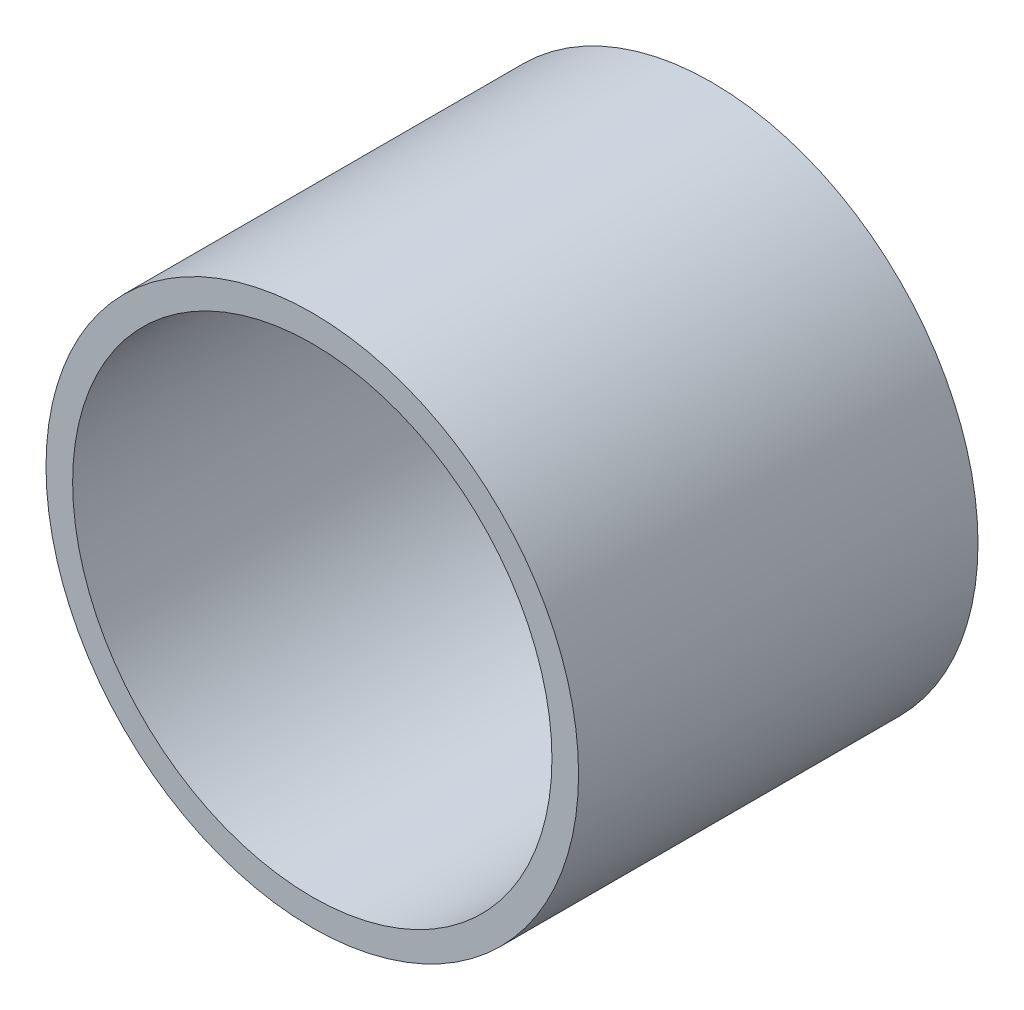
ISO-10303-21;
HEADER;
FILE_DESCRIPTION(('STEP AP214'),'2;1');
FILE_NAME('part.step','',(''),(''),'','','');
FILE_SCHEMA(('AUTOMOTIVE_DESIGN { 1 0 10303 214 1 1 1 1 }'));
ENDSEC;
DATA;
#1=APPLICATION_CONTEXT('core data for automotive mechanical design processes');
#2=APPLICATION_PROTOCOL_DEFINITION('international standard','automotive_design',2000,#1);
#3=PRODUCT_CONTEXT('',#1,'mechanical');
#4=PRODUCT('Part','Part','',(#3));
#5=PRODUCT_RELATED_PRODUCT_CATEGORY('part','',(#4));
#6=PRODUCT_DEFINITION_FORMATION('','',#4);
#7=PRODUCT_DEFINITION_CONTEXT('part definition',#1,'design');
#8=PRODUCT_DEFINITION('design','',#6,#7);
#9=PRODUCT_DEFINITION_SHAPE('','',#8);
#10=(LENGTH_UNIT() NAMED_UNIT(*) SI_UNIT(.MILLI.,.METRE.));
#11=(NAMED_UNIT(*) PLANE_ANGLE_UNIT() SI_UNIT($,.RADIAN.));
#12=(NAMED_UNIT(*) SI_UNIT($,.STERADIAN.) SOLID_ANGLE_UNIT());
#13=UNCERTAINTY_MEASURE_WITH_UNIT(LENGTH_MEASURE(1.E-05),#10,'distance_accuracy_value','');
#14=(GEOMETRIC_REPRESENTATION_CONTEXT(3) GLOBAL_UNCERTAINTY_ASSIGNED_CONTEXT((#13)) GLOBAL_UNIT_ASSIGNED_CONTEXT((#10,
#11,#12)) REPRESENTATION_CONTEXT('',''));
#15=CARTESIAN_POINT('',(0.,0.,0.));
#16=DIRECTION('',(0.,0.,1.));
#17=DIRECTION('',(1.,0.,0.));
#18=AXIS2_PLACEMENT_3D('',#15,#16,#17);
#19=CARTESIAN_POINT('',(0.,0.,6.));
#20=DIRECTION('',(0.,0.,-1.));
#21=DIRECTION('',(-1.,0.,0.));
#22=AXIS2_PLACEMENT_3D('',#19,#20,#21);
#23=CYLINDRICAL_SURFACE('',#22,3.6);
#24=CARTESIAN_POINT('',(0.,0.,0.));
#25=DIRECTION('',(0.,0.,-1.));
#26=DIRECTION('',(-1.,0.,0.));
#27=AXIS2_PLACEMENT_3D('',#24,#25,#26);
#28=CIRCLE('',#27,3.6);
#29=CARTESIAN_POINT('',(-3.6,0.,0.));
#30=VERTEX_POINT('',#29);
#31=EDGE_CURVE('E28',#30,#30,#28,.T.);
#32=ORIENTED_EDGE('',*,*,#31,.T.);
#33=EDGE_LOOP('',(#32));
#34=FACE_BOUND('',#33,.T.);
#35=CARTESIAN_POINT('',(0.,0.,6.));
#36=DIRECTION('',(0.,0.,-1.));
#37=DIRECTION('',(-1.,0.,0.));
#38=AXIS2_PLACEMENT_3D('',#35,#36,#37);
#39=CIRCLE('',#38,3.6);
#40=CARTESIAN_POINT('',(-3.6,0.,6.));
#41=VERTEX_POINT('',#40);
#42=EDGE_CURVE('E19',#41,#41,#39,.T.);
#43=ORIENTED_EDGE('',*,*,#42,.F.);
#44=EDGE_LOOP('',(#43));
#45=FACE_BOUND('',#44,.T.);
#46=ADVANCED_FACE('F16',(#34,#45),#23,.F.);
#47=CARTESIAN_POINT('',(0.,0.,6.));
#48=DIRECTION('',(0.,0.,1.));
#49=DIRECTION('',(1.,0.,0.));
#50=AXIS2_PLACEMENT_3D('',#47,#48,#49);
#51=PLANE('',#50);
#52=ORIENTED_EDGE('',*,*,#42,.T.);
#53=EDGE_LOOP('',(#52));
#54=FACE_BOUND('',#53,.T.);
#55=CARTESIAN_POINT('',(0.,0.,6.));
#56=DIRECTION('',(0.,0.,-1.));
#57=DIRECTION('',(-1.,0.,0.));
#58=AXIS2_PLACEMENT_3D('',#55,#56,#57);
#59=CIRCLE('',#58,4.);
#60=CARTESIAN_POINT('',(-4.,0.,6.));
#61=VERTEX_POINT('',#60);
#62=EDGE_CURVE('E23',#61,#61,#59,.T.);
#63=ORIENTED_EDGE('',*,*,#62,.F.);
#64=EDGE_LOOP('',(#63));
#65=FACE_BOUND('',#64,.T.);
#66=ADVANCED_FACE('F36',(#54,#65),#51,.T.);
#67=CARTESIAN_POINT('',(0.,0.,0.));
#68=DIRECTION('',(0.,0.,1.));
#69=DIRECTION('',(1.,0.,0.));
#70=AXIS2_PLACEMENT_3D('',#67,#68,#69);
#71=PLANE('',#70);
#72=ORIENTED_EDGE('',*,*,#31,.F.);
#73=EDGE_LOOP('',(#72));
#74=FACE_BOUND('',#73,.T.);
#75=CARTESIAN_POINT('',(0.,0.,0.));
#76=DIRECTION('',(0.,0.,-1.));
#77=DIRECTION('',(-1.,0.,0.));
#78=AXIS2_PLACEMENT_3D('',#75,#76,#77);
#79=CIRCLE('',#78,4.);
#80=CARTESIAN_POINT('',(-4.,0.,0.));
#81=VERTEX_POINT('',#80);
#82=EDGE_CURVE('E10',#81,#81,#79,.F.);
#83=ORIENTED_EDGE('',*,*,#82,.F.);
#84=EDGE_LOOP('',(#83));
#85=FACE_BOUND('',#84,.T.);
#86=ADVANCED_FACE('F43',(#74,#85),#71,.F.);
#87=CARTESIAN_POINT('',(0.,0.,6.));
#88=DIRECTION('',(0.,0.,-1.));
#89=DIRECTION('',(-1.,0.,0.));
#90=AXIS2_PLACEMENT_3D('',#87,#88,#89);
#91=CYLINDRICAL_SURFACE('',#90,4.);
#92=ORIENTED_EDGE('',*,*,#82,.T.);
#93=EDGE_LOOP('',(#92));
#94=FACE_BOUND('',#93,.T.);
#95=ORIENTED_EDGE('',*,*,#62,.T.);
#96=EDGE_LOOP('',(#95));
#97=FACE_BOUND('',#96,.T.);
#98=ADVANCED_FACE('F44',(#94,#97),#91,.T.);
#99=CLOSED_SHELL('',(#46,#66,#86,#98));
#100=MANIFOLD_SOLID_BREP('B1',#99);
#101=ADVANCED_BREP_SHAPE_REPRESENTATION('',(#18,#100),#14);
#102=SHAPE_DEFINITION_REPRESENTATION(#9,#101);
ENDSEC;
END-ISO-10303-21;
